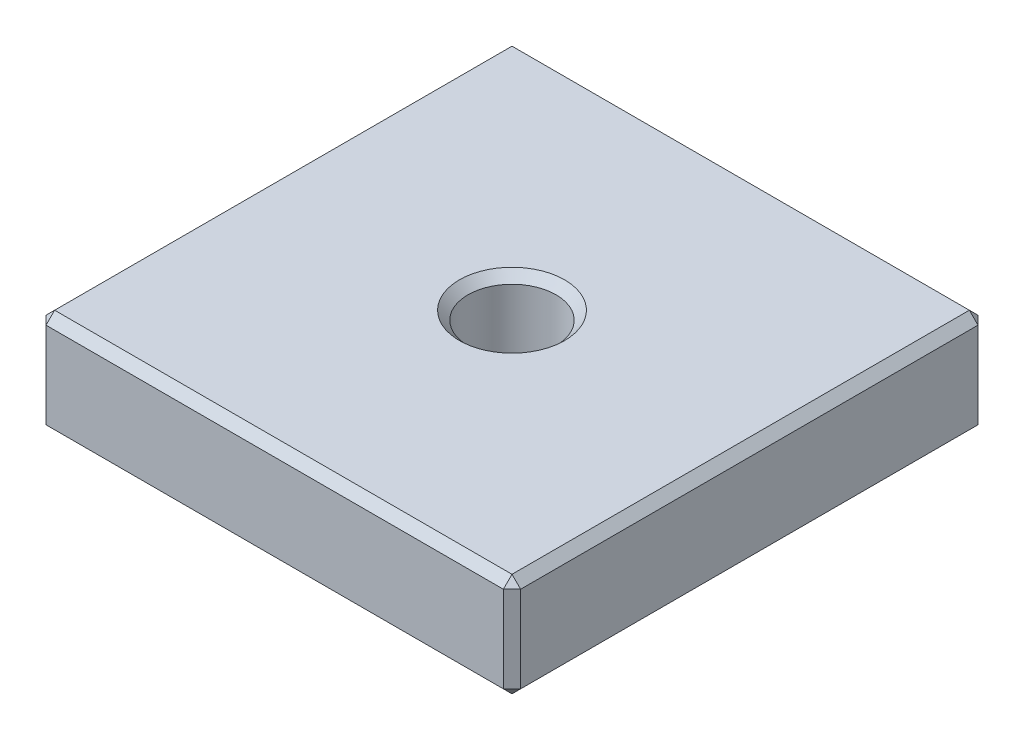
ISO-10303-21;
HEADER;
FILE_DESCRIPTION(('STEP AP214'),'2;1');
FILE_NAME('part.step','',(''),(''),'','','');
FILE_SCHEMA(('AUTOMOTIVE_DESIGN { 1 0 10303 214 1 1 1 1 }'));
ENDSEC;
DATA;
#1=APPLICATION_CONTEXT('core data for automotive mechanical design processes');
#2=APPLICATION_PROTOCOL_DEFINITION('international standard','automotive_design',2000,#1);
#3=PRODUCT_CONTEXT('',#1,'mechanical');
#4=PRODUCT('Part','Part','',(#3));
#5=PRODUCT_RELATED_PRODUCT_CATEGORY('part','',(#4));
#6=PRODUCT_DEFINITION_FORMATION('','',#4);
#7=PRODUCT_DEFINITION_CONTEXT('part definition',#1,'design');
#8=PRODUCT_DEFINITION('design','',#6,#7);
#9=PRODUCT_DEFINITION_SHAPE('','',#8);
#10=(LENGTH_UNIT() NAMED_UNIT(*) SI_UNIT(.MILLI.,.METRE.));
#11=(NAMED_UNIT(*) PLANE_ANGLE_UNIT() SI_UNIT($,.RADIAN.));
#12=(NAMED_UNIT(*) SI_UNIT($,.STERADIAN.) SOLID_ANGLE_UNIT());
#13=UNCERTAINTY_MEASURE_WITH_UNIT(LENGTH_MEASURE(1.E-05),#10,'distance_accuracy_value','');
#14=(GEOMETRIC_REPRESENTATION_CONTEXT(3) GLOBAL_UNCERTAINTY_ASSIGNED_CONTEXT((#13)) GLOBAL_UNIT_ASSIGNED_CONTEXT((#10,
#11,#12)) REPRESENTATION_CONTEXT('',''));
#15=CARTESIAN_POINT('',(0.,0.,0.));
#16=DIRECTION('',(0.,0.,1.));
#17=DIRECTION('',(1.,0.,0.));
#18=AXIS2_PLACEMENT_3D('',#15,#16,#17);
#19=CARTESIAN_POINT('',(0.,12.,0.));
#20=DIRECTION('',(1.,0.,0.));
#21=DIRECTION('',(0.,0.,-1.));
#22=AXIS2_PLACEMENT_3D('',#19,#20,#21);
#23=PLANE('',#22);
#24=DIRECTION('',(0.,1.,0.));
#25=VECTOR('',#24,1.);
#26=CARTESIAN_POINT('',(0.,12.,-1.));
#27=LINE('',#26,#25);
#28=CARTESIAN_POINT('',(0.,1.,-1.));
#29=VERTEX_POINT('',#28);
#30=CARTESIAN_POINT('',(0.,11.,-1.));
#31=VERTEX_POINT('',#30);
#32=EDGE_CURVE('E43',#29,#31,#27,.T.);
#33=ORIENTED_EDGE('',*,*,#32,.T.);
#34=DIRECTION('',(0.,0.,-1.));
#35=VECTOR('',#34,1.);
#36=CARTESIAN_POINT('',(0.,11.,0.));
#37=LINE('',#36,#35);
#38=CARTESIAN_POINT('',(0.,11.,-54.));
#39=VERTEX_POINT('',#38);
#40=EDGE_CURVE('E11',#31,#39,#37,.T.);
#41=ORIENTED_EDGE('',*,*,#40,.T.);
#42=DIRECTION('',(0.,-1.,0.));
#43=VECTOR('',#42,1.);
#44=CARTESIAN_POINT('',(0.,12.,-54.));
#45=LINE('',#44,#43);
#46=CARTESIAN_POINT('',(0.,1.,-54.));
#47=VERTEX_POINT('',#46);
#48=EDGE_CURVE('E208',#39,#47,#45,.T.);
#49=ORIENTED_EDGE('',*,*,#48,.T.);
#50=DIRECTION('',(0.,0.,1.));
#51=VECTOR('',#50,1.);
#52=CARTESIAN_POINT('',(0.,1.,0.));
#53=LINE('',#52,#51);
#54=EDGE_CURVE('E54',#47,#29,#53,.T.);
#55=ORIENTED_EDGE('',*,*,#54,.T.);
#56=EDGE_LOOP('',(#33,#41,#49,#55));
#57=FACE_BOUND('',#56,.T.);
#58=ADVANCED_FACE('F34',(#57),#23,.F.);
#59=CARTESIAN_POINT('',(0.,12.,0.));
#60=DIRECTION('',(0.,0.,-1.));
#61=DIRECTION('',(-1.,0.,0.));
#62=AXIS2_PLACEMENT_3D('',#59,#60,#61);
#63=PLANE('',#62);
#64=DIRECTION('',(1.,0.,0.));
#65=VECTOR('',#64,1.);
#66=CARTESIAN_POINT('',(55.,1.,0.));
#67=LINE('',#66,#65);
#68=CARTESIAN_POINT('',(1.00000000000001,1.,0.));
#69=VERTEX_POINT('',#68);
#70=CARTESIAN_POINT('',(54.,1.,0.));
#71=VERTEX_POINT('',#70);
#72=EDGE_CURVE('E201',#69,#71,#67,.T.);
#73=ORIENTED_EDGE('',*,*,#72,.T.);
#74=DIRECTION('',(0.,1.,0.));
#75=VECTOR('',#74,1.);
#76=CARTESIAN_POINT('',(54.,12.,0.));
#77=LINE('',#76,#75);
#78=CARTESIAN_POINT('',(54.,11.,0.));
#79=VERTEX_POINT('',#78);
#80=EDGE_CURVE('E206',#71,#79,#77,.T.);
#81=ORIENTED_EDGE('',*,*,#80,.T.);
#82=DIRECTION('',(-1.,0.,0.));
#83=VECTOR('',#82,1.);
#84=CARTESIAN_POINT('',(0.,11.,0.));
#85=LINE('',#84,#83);
#86=CARTESIAN_POINT('',(1.00000000000001,11.,0.));
#87=VERTEX_POINT('',#86);
#88=EDGE_CURVE('E203',#79,#87,#85,.T.);
#89=ORIENTED_EDGE('',*,*,#88,.T.);
#90=DIRECTION('',(0.,-1.,0.));
#91=VECTOR('',#90,1.);
#92=CARTESIAN_POINT('',(1.00000000000001,12.,0.));
#93=LINE('',#92,#91);
#94=EDGE_CURVE('E199',#87,#69,#93,.T.);
#95=ORIENTED_EDGE('',*,*,#94,.T.);
#96=EDGE_LOOP('',(#73,#81,#89,#95));
#97=FACE_BOUND('',#96,.T.);
#98=ADVANCED_FACE('F294',(#97),#63,.F.);
#99=CARTESIAN_POINT('',(55.,12.,0.));
#100=DIRECTION('',(-1.,0.,0.));
#101=DIRECTION('',(0.,0.,1.));
#102=AXIS2_PLACEMENT_3D('',#99,#100,#101);
#103=PLANE('',#102);
#104=DIRECTION('',(0.,1.,0.));
#105=VECTOR('',#104,1.);
#106=CARTESIAN_POINT('',(55.,12.,-54.));
#107=LINE('',#106,#105);
#108=CARTESIAN_POINT('',(55.,1.,-54.));
#109=VERTEX_POINT('',#108);
#110=CARTESIAN_POINT('',(55.,11.,-54.));
#111=VERTEX_POINT('',#110);
#112=EDGE_CURVE('E190',#109,#111,#107,.T.);
#113=ORIENTED_EDGE('',*,*,#112,.T.);
#114=DIRECTION('',(0.,0.,1.));
#115=VECTOR('',#114,1.);
#116=CARTESIAN_POINT('',(55.,11.,0.));
#117=LINE('',#116,#115);
#118=CARTESIAN_POINT('',(55.,11.,-1.));
#119=VERTEX_POINT('',#118);
#120=EDGE_CURVE('E196',#111,#119,#117,.T.);
#121=ORIENTED_EDGE('',*,*,#120,.T.);
#122=DIRECTION('',(0.,-1.,0.));
#123=VECTOR('',#122,1.);
#124=CARTESIAN_POINT('',(55.,12.,-1.));
#125=LINE('',#124,#123);
#126=CARTESIAN_POINT('',(55.,1.,-1.));
#127=VERTEX_POINT('',#126);
#128=EDGE_CURVE('E194',#119,#127,#125,.T.);
#129=ORIENTED_EDGE('',*,*,#128,.T.);
#130=DIRECTION('',(0.,0.,-1.));
#131=VECTOR('',#130,1.);
#132=CARTESIAN_POINT('',(55.,1.,-55.));
#133=LINE('',#132,#131);
#134=EDGE_CURVE('E192',#127,#109,#133,.T.);
#135=ORIENTED_EDGE('',*,*,#134,.T.);
#136=EDGE_LOOP('',(#113,#121,#129,#135));
#137=FACE_BOUND('',#136,.T.);
#138=ADVANCED_FACE('F285',(#137),#103,.F.);
#139=CARTESIAN_POINT('',(0.,12.,-55.));
#140=DIRECTION('',(0.,0.,1.));
#141=DIRECTION('',(1.,0.,0.));
#142=AXIS2_PLACEMENT_3D('',#139,#140,#141);
#143=PLANE('',#142);
#144=DIRECTION('',(0.,1.,0.));
#145=VECTOR('',#144,1.);
#146=CARTESIAN_POINT('',(1.00000000000001,12.,-55.));
#147=LINE('',#146,#145);
#148=CARTESIAN_POINT('',(1.00000000000001,1.00000000000001,-55.));
#149=VERTEX_POINT('',#148);
#150=CARTESIAN_POINT('',(1.00000000000001,11.,-55.));
#151=VERTEX_POINT('',#150);
#152=EDGE_CURVE('E183',#149,#151,#147,.T.);
#153=ORIENTED_EDGE('',*,*,#152,.T.);
#154=DIRECTION('',(1.,0.,0.));
#155=VECTOR('',#154,1.);
#156=CARTESIAN_POINT('',(0.,11.,-55.));
#157=LINE('',#156,#155);
#158=CARTESIAN_POINT('',(54.,11.,-55.));
#159=VERTEX_POINT('',#158);
#160=EDGE_CURVE('E130',#151,#159,#157,.T.);
#161=ORIENTED_EDGE('',*,*,#160,.T.);
#162=DIRECTION('',(0.,-1.,0.));
#163=VECTOR('',#162,1.);
#164=CARTESIAN_POINT('',(54.,12.,-55.));
#165=LINE('',#164,#163);
#166=CARTESIAN_POINT('',(54.,1.00000000000001,-55.));
#167=VERTEX_POINT('',#166);
#168=EDGE_CURVE('E187',#159,#167,#165,.T.);
#169=ORIENTED_EDGE('',*,*,#168,.T.);
#170=DIRECTION('',(-1.,0.,0.));
#171=VECTOR('',#170,1.);
#172=CARTESIAN_POINT('',(0.,1.00000000000001,-55.));
#173=LINE('',#172,#171);
#174=EDGE_CURVE('E185',#167,#149,#173,.T.);
#175=ORIENTED_EDGE('',*,*,#174,.T.);
#176=EDGE_LOOP('',(#153,#161,#169,#175));
#177=FACE_BOUND('',#176,.T.);
#178=ADVANCED_FACE('F321',(#177),#143,.F.);
#179=CARTESIAN_POINT('',(0.,12.,-55.));
#180=DIRECTION('',(0.,-1.,0.));
#181=DIRECTION('',(0.,0.,-1.));
#182=AXIS2_PLACEMENT_3D('',#179,#180,#181);
#183=PLANE('',#182);
#184=CARTESIAN_POINT('',(27.5,12.,-27.5));
#185=DIRECTION('',(0.,-1.,0.));
#186=DIRECTION('',(0.,0.,-1.));
#187=AXIS2_PLACEMENT_3D('',#184,#185,#186);
#188=CIRCLE('',#187,6.09999999999997);
#189=CARTESIAN_POINT('',(27.5,12.,-33.6));
#190=VERTEX_POINT('',#189);
#191=EDGE_CURVE('E158',#190,#190,#188,.T.);
#192=ORIENTED_EDGE('',*,*,#191,.T.);
#193=EDGE_LOOP('',(#192));
#194=FACE_BOUND('',#193,.T.);
#195=DIRECTION('',(0.,0.,-1.));
#196=VECTOR('',#195,1.);
#197=CARTESIAN_POINT('',(54.,12.,-55.));
#198=LINE('',#197,#196);
#199=CARTESIAN_POINT('',(54.,12.,-1.));
#200=VERTEX_POINT('',#199);
#201=CARTESIAN_POINT('',(54.,12.,-54.));
#202=VERTEX_POINT('',#201);
#203=EDGE_CURVE('E156',#200,#202,#198,.T.);
#204=ORIENTED_EDGE('',*,*,#203,.T.);
#205=DIRECTION('',(-1.,0.,0.));
#206=VECTOR('',#205,1.);
#207=CARTESIAN_POINT('',(0.,12.,-54.));
#208=LINE('',#207,#206);
#209=CARTESIAN_POINT('',(1.00000000000001,12.,-54.));
#210=VERTEX_POINT('',#209);
#211=EDGE_CURVE('E128',#202,#210,#208,.T.);
#212=ORIENTED_EDGE('',*,*,#211,.T.);
#213=DIRECTION('',(0.,0.,1.));
#214=VECTOR('',#213,1.);
#215=CARTESIAN_POINT('',(1.00000000000001,12.,-55.));
#216=LINE('',#215,#214);
#217=CARTESIAN_POINT('',(1.00000000000001,12.,-1.));
#218=VERTEX_POINT('',#217);
#219=EDGE_CURVE('E146',#210,#218,#216,.T.);
#220=ORIENTED_EDGE('',*,*,#219,.T.);
#221=DIRECTION('',(1.,0.,0.));
#222=VECTOR('',#221,1.);
#223=CARTESIAN_POINT('',(0.,12.,-1.));
#224=LINE('',#223,#222);
#225=EDGE_CURVE('E152',#218,#200,#224,.T.);
#226=ORIENTED_EDGE('',*,*,#225,.T.);
#227=EDGE_LOOP('',(#204,#212,#220,#226));
#228=FACE_BOUND('',#227,.T.);
#229=ADVANCED_FACE('F154',(#194,#228),#183,.F.);
#230=CARTESIAN_POINT('',(0.,0.,-55.));
#231=DIRECTION('',(0.,-1.,0.));
#232=DIRECTION('',(0.,0.,-1.));
#233=AXIS2_PLACEMENT_3D('',#230,#231,#232);
#234=PLANE('',#233);
#235=CARTESIAN_POINT('',(27.5,0.,-27.5));
#236=DIRECTION('',(0.,-1.,0.));
#237=DIRECTION('',(0.,0.,-1.));
#238=AXIS2_PLACEMENT_3D('',#235,#236,#237);
#239=CIRCLE('',#238,6.09999999999998);
#240=CARTESIAN_POINT('',(27.5,0.,-33.6));
#241=VERTEX_POINT('',#240);
#242=EDGE_CURVE('E180',#241,#241,#239,.F.);
#243=ORIENTED_EDGE('',*,*,#242,.T.);
#244=EDGE_LOOP('',(#243));
#245=FACE_BOUND('',#244,.T.);
#246=DIRECTION('',(0.,0.,1.));
#247=VECTOR('',#246,1.);
#248=CARTESIAN_POINT('',(54.,0.,0.));
#249=LINE('',#248,#247);
#250=CARTESIAN_POINT('',(54.,0.,-54.));
#251=VERTEX_POINT('',#250);
#252=CARTESIAN_POINT('',(54.,0.,-1.00000000000001));
#253=VERTEX_POINT('',#252);
#254=EDGE_CURVE('E175',#251,#253,#249,.T.);
#255=ORIENTED_EDGE('',*,*,#254,.T.);
#256=DIRECTION('',(-1.,0.,0.));
#257=VECTOR('',#256,1.);
#258=CARTESIAN_POINT('',(0.,0.,-1.00000000000001));
#259=LINE('',#258,#257);
#260=CARTESIAN_POINT('',(1.00000000000001,0.,-1.00000000000001));
#261=VERTEX_POINT('',#260);
#262=EDGE_CURVE('E177',#253,#261,#259,.T.);
#263=ORIENTED_EDGE('',*,*,#262,.T.);
#264=DIRECTION('',(0.,0.,-1.));
#265=VECTOR('',#264,1.);
#266=CARTESIAN_POINT('',(1.00000000000001,0.,-55.));
#267=LINE('',#266,#265);
#268=CARTESIAN_POINT('',(1.00000000000001,0.,-54.));
#269=VERTEX_POINT('',#268);
#270=EDGE_CURVE('E171',#261,#269,#267,.T.);
#271=ORIENTED_EDGE('',*,*,#270,.T.);
#272=DIRECTION('',(1.,0.,0.));
#273=VECTOR('',#272,1.);
#274=CARTESIAN_POINT('',(55.,0.,-54.));
#275=LINE('',#274,#273);
#276=EDGE_CURVE('E173',#269,#251,#275,.T.);
#277=ORIENTED_EDGE('',*,*,#276,.T.);
#278=EDGE_LOOP('',(#255,#263,#271,#277));
#279=FACE_BOUND('',#278,.T.);
#280=ADVANCED_FACE('F305',(#245,#279),#234,.T.);
#281=CARTESIAN_POINT('',(27.5,0.,-27.5));
#282=DIRECTION('',(0.,-1.,0.));
#283=DIRECTION('',(0.,0.,-1.));
#284=AXIS2_PLACEMENT_3D('',#281,#282,#283);
#285=CYLINDRICAL_SURFACE('',#284,5.09999999999999);
#286=CARTESIAN_POINT('',(27.5,11.,-27.5));
#287=DIRECTION('',(0.,-1.,0.));
#288=DIRECTION('',(0.,0.,-1.));
#289=AXIS2_PLACEMENT_3D('',#286,#287,#288);
#290=CIRCLE('',#289,5.09999999999999);
#291=CARTESIAN_POINT('',(27.5,11.,-32.6));
#292=VERTEX_POINT('',#291);
#293=EDGE_CURVE('E168',#292,#292,#290,.F.);
#294=ORIENTED_EDGE('',*,*,#293,.T.);
#295=EDGE_LOOP('',(#294));
#296=FACE_BOUND('',#295,.T.);
#297=CARTESIAN_POINT('',(27.5,0.999999999999984,-27.5));
#298=DIRECTION('',(0.,-1.,0.));
#299=DIRECTION('',(0.,0.,-1.));
#300=AXIS2_PLACEMENT_3D('',#297,#298,#299);
#301=CIRCLE('',#300,5.09999999999999);
#302=CARTESIAN_POINT('',(27.5,0.999999999999984,-32.6));
#303=VERTEX_POINT('',#302);
#304=EDGE_CURVE('E161',#303,#303,#301,.T.);
#305=ORIENTED_EDGE('',*,*,#304,.T.);
#306=EDGE_LOOP('',(#305));
#307=FACE_BOUND('',#306,.T.);
#308=ADVANCED_FACE('F356',(#296,#307),#285,.F.);
#309=CARTESIAN_POINT('',(27.5,12.,-27.5));
#310=DIRECTION('',(0.,1.,0.));
#311=DIRECTION('',(0.,0.,1.));
#312=AXIS2_PLACEMENT_3D('',#309,#310,#311);
#313=CONICAL_SURFACE('',#312,6.09999999999997,0.785398163397447);
#314=ORIENTED_EDGE('',*,*,#293,.F.);
#315=EDGE_LOOP('',(#314));
#316=FACE_BOUND('',#315,.T.);
#317=ORIENTED_EDGE('',*,*,#191,.F.);
#318=EDGE_LOOP('',(#317));
#319=FACE_BOUND('',#318,.T.);
#320=ADVANCED_FACE('F352',(#316,#319),#313,.F.);
#321=CARTESIAN_POINT('',(27.5,0.999999999999984,-27.5));
#322=DIRECTION('',(0.,-1.,0.));
#323=DIRECTION('',(0.,0.,-1.));
#324=AXIS2_PLACEMENT_3D('',#321,#322,#323);
#325=CONICAL_SURFACE('',#324,5.09999999999999,0.785398163397447);
#326=ORIENTED_EDGE('',*,*,#242,.F.);
#327=EDGE_LOOP('',(#326));
#328=FACE_BOUND('',#327,.T.);
#329=ORIENTED_EDGE('',*,*,#304,.F.);
#330=EDGE_LOOP('',(#329));
#331=FACE_BOUND('',#330,.T.);
#332=ADVANCED_FACE('F355',(#328,#331),#325,.F.);
#333=CARTESIAN_POINT('',(0.,1.,0.));
#334=DIRECTION('',(0.,-0.70710678118655,0.707106781186545));
#335=DIRECTION('',(0.,-0.707106781186545,-0.70710678118655));
#336=AXIS2_PLACEMENT_3D('',#333,#334,#335);
#337=PLANE('',#336);
#338=DIRECTION('',(0.,-0.707106781186545,-0.70710678118655));
#339=VECTOR('',#338,1.);
#340=CARTESIAN_POINT('',(54.,1.,0.));
#341=LINE('',#340,#339);
#342=EDGE_CURVE('E38',#71,#253,#341,.T.);
#343=ORIENTED_EDGE('',*,*,#342,.F.);
#344=ORIENTED_EDGE('',*,*,#72,.F.);
#345=DIRECTION('',(0.,0.707106781186545,0.70710678118655));
#346=VECTOR('',#345,1.);
#347=CARTESIAN_POINT('',(1.00000000000001,0.,-1.00000000000001));
#348=LINE('',#347,#346);
#349=EDGE_CURVE('E261',#261,#69,#348,.T.);
#350=ORIENTED_EDGE('',*,*,#349,.F.);
#351=ORIENTED_EDGE('',*,*,#262,.F.);
#352=EDGE_LOOP('',(#343,#344,#350,#351));
#353=FACE_BOUND('',#352,.T.);
#354=ADVANCED_FACE('F36',(#353),#337,.T.);
#355=CARTESIAN_POINT('',(54.,1.,0.));
#356=DIRECTION('',(0.577350269189622,-0.57735026918963,0.577350269189626));
#357=DIRECTION('',(0.,-0.707106781186545,-0.70710678118655));
#358=AXIS2_PLACEMENT_3D('',#355,#356,#357);
#359=PLANE('',#358);
#360=DIRECTION('',(0.70710678118655,0.,-0.707106781186545));
#361=VECTOR('',#360,1.);
#362=CARTESIAN_POINT('',(54.,1.,0.));
#363=LINE('',#362,#361);
#364=EDGE_CURVE('E256',#71,#127,#363,.T.);
#365=ORIENTED_EDGE('',*,*,#364,.F.);
#366=ORIENTED_EDGE('',*,*,#342,.T.);
#367=DIRECTION('',(0.70710678118655,0.707106781186545,0.));
#368=VECTOR('',#367,1.);
#369=CARTESIAN_POINT('',(54.5,0.5,-1.));
#370=LINE('',#369,#368);
#371=EDGE_CURVE('E259',#127,#253,#370,.F.);
#372=ORIENTED_EDGE('',*,*,#371,.F.);
#373=EDGE_LOOP('',(#365,#366,#372));
#374=FACE_BOUND('',#373,.T.);
#375=ADVANCED_FACE('F272',(#374),#359,.T.);
#376=CARTESIAN_POINT('',(1.00000000000001,0.,-1.00000000000001));
#377=DIRECTION('',(-0.577350269189622,-0.57735026918963,0.577350269189626));
#378=DIRECTION('',(0.,-0.707106781186545,-0.70710678118655));
#379=AXIS2_PLACEMENT_3D('',#376,#377,#378);
#380=PLANE('',#379);
#381=DIRECTION('',(0.70710678118655,-0.707106781186545,0.));
#382=VECTOR('',#381,1.);
#383=CARTESIAN_POINT('',(1.00000000000001,0.,-1.00000000000001));
#384=LINE('',#383,#382);
#385=EDGE_CURVE('E251',#261,#29,#384,.F.);
#386=ORIENTED_EDGE('',*,*,#385,.F.);
#387=ORIENTED_EDGE('',*,*,#349,.T.);
#388=DIRECTION('',(0.70710678118655,0.,0.707106781186545));
#389=VECTOR('',#388,1.);
#390=CARTESIAN_POINT('',(0.500000000000004,1.,-0.5));
#391=LINE('',#390,#389);
#392=EDGE_CURVE('E253',#29,#69,#391,.T.);
#393=ORIENTED_EDGE('',*,*,#392,.F.);
#394=EDGE_LOOP('',(#386,#387,#393));
#395=FACE_BOUND('',#394,.T.);
#396=ADVANCED_FACE('F480',(#395),#380,.T.);
#397=CARTESIAN_POINT('',(55.,1.,0.));
#398=DIRECTION('',(0.707106781186545,-0.70710678118655,0.));
#399=DIRECTION('',(0.70710678118655,0.707106781186545,0.));
#400=AXIS2_PLACEMENT_3D('',#397,#398,#399);
#401=PLANE('',#400);
#402=ORIENTED_EDGE('',*,*,#371,.T.);
#403=ORIENTED_EDGE('',*,*,#254,.F.);
#404=DIRECTION('',(-0.70710678118655,-0.707106781186545,0.));
#405=VECTOR('',#404,1.);
#406=CARTESIAN_POINT('',(55.,1.,-54.));
#407=LINE('',#406,#405);
#408=EDGE_CURVE('E245',#109,#251,#407,.T.);
#409=ORIENTED_EDGE('',*,*,#408,.F.);
#410=ORIENTED_EDGE('',*,*,#134,.F.);
#411=EDGE_LOOP('',(#402,#403,#409,#410));
#412=FACE_BOUND('',#411,.T.);
#413=ADVANCED_FACE('F280',(#412),#401,.T.);
#414=CARTESIAN_POINT('',(55.,12.,-1.));
#415=DIRECTION('',(-0.707106781186545,0.,-0.70710678118655));
#416=DIRECTION('',(-0.70710678118655,0.,0.707106781186545));
#417=AXIS2_PLACEMENT_3D('',#414,#415,#416);
#418=PLANE('',#417);
#419=ORIENTED_EDGE('',*,*,#364,.T.);
#420=ORIENTED_EDGE('',*,*,#128,.F.);
#421=DIRECTION('',(-0.70710678118655,0.,0.707106781186545));
#422=VECTOR('',#421,1.);
#423=CARTESIAN_POINT('',(55.,11.,-1.));
#424=LINE('',#423,#422);
#425=EDGE_CURVE('E242',#79,#119,#424,.F.);
#426=ORIENTED_EDGE('',*,*,#425,.F.);
#427=ORIENTED_EDGE('',*,*,#80,.F.);
#428=EDGE_LOOP('',(#419,#420,#426,#427));
#429=FACE_BOUND('',#428,.T.);
#430=ADVANCED_FACE('F291',(#429),#418,.F.);
#431=CARTESIAN_POINT('',(0.,12.,-1.));
#432=DIRECTION('',(0.,-0.707106781186545,-0.70710678118655));
#433=DIRECTION('',(0.,0.70710678118655,-0.707106781186545));
#434=AXIS2_PLACEMENT_3D('',#431,#432,#433);
#435=PLANE('',#434);
#436=DIRECTION('',(0.,-0.70710678118655,0.707106781186545));
#437=VECTOR('',#436,1.);
#438=CARTESIAN_POINT('',(1.00000000000001,11.,0.));
#439=LINE('',#438,#437);
#440=EDGE_CURVE('E236',#87,#218,#439,.F.);
#441=ORIENTED_EDGE('',*,*,#440,.F.);
#442=ORIENTED_EDGE('',*,*,#88,.F.);
#443=DIRECTION('',(0.,0.70710678118655,-0.707106781186545));
#444=VECTOR('',#443,1.);
#445=CARTESIAN_POINT('',(54.,11.5,-0.5));
#446=LINE('',#445,#444);
#447=EDGE_CURVE('E239',#200,#79,#446,.F.);
#448=ORIENTED_EDGE('',*,*,#447,.F.);
#449=ORIENTED_EDGE('',*,*,#225,.F.);
#450=EDGE_LOOP('',(#441,#442,#448,#449));
#451=FACE_BOUND('',#450,.T.);
#452=ADVANCED_FACE('F298',(#451),#435,.F.);
#453=CARTESIAN_POINT('',(1.00000000000001,12.,0.));
#454=DIRECTION('',(0.707106781186545,0.,-0.70710678118655));
#455=DIRECTION('',(-0.70710678118655,0.,-0.707106781186545));
#456=AXIS2_PLACEMENT_3D('',#453,#454,#455);
#457=PLANE('',#456);
#458=ORIENTED_EDGE('',*,*,#392,.T.);
#459=ORIENTED_EDGE('',*,*,#94,.F.);
#460=DIRECTION('',(-0.70710678118655,0.,-0.707106781186545));
#461=VECTOR('',#460,1.);
#462=CARTESIAN_POINT('',(1.00000000000001,11.,0.));
#463=LINE('',#462,#461);
#464=EDGE_CURVE('E234',#31,#87,#463,.F.);
#465=ORIENTED_EDGE('',*,*,#464,.F.);
#466=ORIENTED_EDGE('',*,*,#32,.F.);
#467=EDGE_LOOP('',(#458,#459,#465,#466));
#468=FACE_BOUND('',#467,.T.);
#469=ADVANCED_FACE('F303',(#468),#457,.F.);
#470=CARTESIAN_POINT('',(0.,1.,0.));
#471=DIRECTION('',(-0.707106781186545,-0.70710678118655,0.));
#472=DIRECTION('',(0.70710678118655,-0.707106781186545,0.));
#473=AXIS2_PLACEMENT_3D('',#470,#471,#472);
#474=PLANE('',#473);
#475=ORIENTED_EDGE('',*,*,#385,.T.);
#476=ORIENTED_EDGE('',*,*,#54,.F.);
#477=DIRECTION('',(-0.70710678118655,0.707106781186545,0.));
#478=VECTOR('',#477,1.);
#479=CARTESIAN_POINT('',(0.500000000000004,0.5,-54.));
#480=LINE('',#479,#478);
#481=EDGE_CURVE('E231',#269,#47,#480,.T.);
#482=ORIENTED_EDGE('',*,*,#481,.F.);
#483=ORIENTED_EDGE('',*,*,#270,.F.);
#484=EDGE_LOOP('',(#475,#476,#482,#483));
#485=FACE_BOUND('',#484,.T.);
#486=ADVANCED_FACE('F314',(#485),#474,.T.);
#487=CARTESIAN_POINT('',(0.,1.00000000000001,-55.));
#488=DIRECTION('',(0.,-0.707106781186545,-0.70710678118655));
#489=DIRECTION('',(0.,0.70710678118655,-0.707106781186545));
#490=AXIS2_PLACEMENT_3D('',#487,#488,#489);
#491=PLANE('',#490);
#492=DIRECTION('',(0.,0.70710678118655,-0.707106781186545));
#493=VECTOR('',#492,1.);
#494=CARTESIAN_POINT('',(54.,0.500000000000004,-54.5));
#495=LINE('',#494,#493);
#496=EDGE_CURVE('E248',#251,#167,#495,.T.);
#497=ORIENTED_EDGE('',*,*,#496,.F.);
#498=ORIENTED_EDGE('',*,*,#276,.F.);
#499=DIRECTION('',(0.,-0.70710678118655,0.707106781186545));
#500=VECTOR('',#499,1.);
#501=CARTESIAN_POINT('',(1.00000000000001,1.00000000000001,-55.));
#502=LINE('',#501,#500);
#503=EDGE_CURVE('E228',#149,#269,#502,.T.);
#504=ORIENTED_EDGE('',*,*,#503,.F.);
#505=ORIENTED_EDGE('',*,*,#174,.F.);
#506=EDGE_LOOP('',(#497,#498,#504,#505));
#507=FACE_BOUND('',#506,.T.);
#508=ADVANCED_FACE('F310',(#507),#491,.T.);
#509=CARTESIAN_POINT('',(55.,1.,-54.));
#510=DIRECTION('',(0.577350269189622,-0.577350269189626,-0.57735026918963));
#511=DIRECTION('',(0.,0.70710678118655,-0.707106781186545));
#512=AXIS2_PLACEMENT_3D('',#509,#510,#511);
#513=PLANE('',#512);
#514=ORIENTED_EDGE('',*,*,#408,.T.);
#515=ORIENTED_EDGE('',*,*,#496,.T.);
#516=DIRECTION('',(-0.70710678118655,0.,-0.707106781186545));
#517=VECTOR('',#516,1.);
#518=CARTESIAN_POINT('',(55.,1.,-54.));
#519=LINE('',#518,#517);
#520=EDGE_CURVE('E225',#109,#167,#519,.T.);
#521=ORIENTED_EDGE('',*,*,#520,.F.);
#522=EDGE_LOOP('',(#514,#515,#521));
#523=FACE_BOUND('',#522,.T.);
#524=ADVANCED_FACE('F324',(#523),#513,.T.);
#525=CARTESIAN_POINT('',(55.,11.,-1.));
#526=DIRECTION('',(0.577350269189626,0.577350269189622,0.57735026918963));
#527=DIRECTION('',(0.70710678118655,0.,-0.707106781186545));
#528=AXIS2_PLACEMENT_3D('',#525,#526,#527);
#529=PLANE('',#528);
#530=ORIENTED_EDGE('',*,*,#447,.T.);
#531=ORIENTED_EDGE('',*,*,#425,.T.);
#532=DIRECTION('',(0.707106781186545,-0.70710678118655,0.));
#533=VECTOR('',#532,1.);
#534=CARTESIAN_POINT('',(55.,11.,-1.));
#535=LINE('',#534,#533);
#536=EDGE_CURVE('E223',#200,#119,#535,.T.);
#537=ORIENTED_EDGE('',*,*,#536,.F.);
#538=EDGE_LOOP('',(#530,#531,#537));
#539=FACE_BOUND('',#538,.T.);
#540=ADVANCED_FACE('F334',(#539),#529,.T.);
#541=CARTESIAN_POINT('',(1.00000000000001,11.,0.));
#542=DIRECTION('',(-0.577350269189622,0.577350269189626,0.57735026918963));
#543=DIRECTION('',(0.,-0.70710678118655,0.707106781186545));
#544=AXIS2_PLACEMENT_3D('',#541,#542,#543);
#545=PLANE('',#544);
#546=ORIENTED_EDGE('',*,*,#464,.T.);
#547=ORIENTED_EDGE('',*,*,#440,.T.);
#548=DIRECTION('',(0.70710678118655,0.707106781186545,0.));
#549=VECTOR('',#548,1.);
#550=CARTESIAN_POINT('',(0.500000000000004,11.5,-1.));
#551=LINE('',#550,#549);
#552=EDGE_CURVE('E149',#31,#218,#551,.T.);
#553=ORIENTED_EDGE('',*,*,#552,.F.);
#554=EDGE_LOOP('',(#546,#547,#553));
#555=FACE_BOUND('',#554,.T.);
#556=ADVANCED_FACE('F336',(#555),#545,.T.);
#557=CARTESIAN_POINT('',(1.00000000000001,1.00000000000001,-55.));
#558=DIRECTION('',(-0.577350269189622,-0.577350269189626,-0.57735026918963));
#559=DIRECTION('',(0.,0.70710678118655,-0.707106781186545));
#560=AXIS2_PLACEMENT_3D('',#557,#558,#559);
#561=PLANE('',#560);
#562=ORIENTED_EDGE('',*,*,#503,.T.);
#563=ORIENTED_EDGE('',*,*,#481,.T.);
#564=DIRECTION('',(-0.70710678118655,0.,0.707106781186545));
#565=VECTOR('',#564,1.);
#566=CARTESIAN_POINT('',(1.00000000000001,1.00000000000001,-55.));
#567=LINE('',#566,#565);
#568=EDGE_CURVE('E219',#149,#47,#567,.T.);
#569=ORIENTED_EDGE('',*,*,#568,.F.);
#570=EDGE_LOOP('',(#562,#563,#569));
#571=FACE_BOUND('',#570,.T.);
#572=ADVANCED_FACE('F316',(#571),#561,.T.);
#573=CARTESIAN_POINT('',(54.,12.,-55.));
#574=DIRECTION('',(-0.707106781186545,0.,0.70710678118655));
#575=DIRECTION('',(0.70710678118655,0.,0.707106781186545));
#576=AXIS2_PLACEMENT_3D('',#573,#574,#575);
#577=PLANE('',#576);
#578=ORIENTED_EDGE('',*,*,#520,.T.);
#579=ORIENTED_EDGE('',*,*,#168,.F.);
#580=DIRECTION('',(0.70710678118655,0.,0.707106781186545));
#581=VECTOR('',#580,1.);
#582=CARTESIAN_POINT('',(54.,11.,-55.));
#583=LINE('',#582,#581);
#584=EDGE_CURVE('E216',#111,#159,#583,.F.);
#585=ORIENTED_EDGE('',*,*,#584,.F.);
#586=ORIENTED_EDGE('',*,*,#112,.F.);
#587=EDGE_LOOP('',(#578,#579,#585,#586));
#588=FACE_BOUND('',#587,.T.);
#589=ADVANCED_FACE('F326',(#588),#577,.F.);
#590=CARTESIAN_POINT('',(54.,12.,-55.));
#591=DIRECTION('',(-0.70710678118655,-0.707106781186545,0.));
#592=DIRECTION('',(0.707106781186545,-0.70710678118655,0.));
#593=AXIS2_PLACEMENT_3D('',#590,#591,#592);
#594=PLANE('',#593);
#595=ORIENTED_EDGE('',*,*,#536,.T.);
#596=ORIENTED_EDGE('',*,*,#120,.F.);
#597=DIRECTION('',(-0.707106781186545,0.70710678118655,0.));
#598=VECTOR('',#597,1.);
#599=CARTESIAN_POINT('',(54.5,11.5,-54.));
#600=LINE('',#599,#598);
#601=EDGE_CURVE('E143',#202,#111,#600,.F.);
#602=ORIENTED_EDGE('',*,*,#601,.F.);
#603=ORIENTED_EDGE('',*,*,#203,.F.);
#604=EDGE_LOOP('',(#595,#596,#602,#603));
#605=FACE_BOUND('',#604,.T.);
#606=ADVANCED_FACE('F332',(#605),#594,.F.);
#607=CARTESIAN_POINT('',(1.00000000000001,12.,-55.));
#608=DIRECTION('',(0.707106781186545,-0.70710678118655,0.));
#609=DIRECTION('',(0.70710678118655,0.707106781186545,0.));
#610=AXIS2_PLACEMENT_3D('',#607,#608,#609);
#611=PLANE('',#610);
#612=ORIENTED_EDGE('',*,*,#552,.T.);
#613=ORIENTED_EDGE('',*,*,#219,.F.);
#614=DIRECTION('',(-0.70710678118655,-0.707106781186545,0.));
#615=VECTOR('',#614,1.);
#616=CARTESIAN_POINT('',(1.00000000000001,12.,-54.));
#617=LINE('',#616,#615);
#618=EDGE_CURVE('E135',#39,#210,#617,.F.);
#619=ORIENTED_EDGE('',*,*,#618,.F.);
#620=ORIENTED_EDGE('',*,*,#40,.F.);
#621=EDGE_LOOP('',(#612,#613,#619,#620));
#622=FACE_BOUND('',#621,.T.);
#623=ADVANCED_FACE('F147',(#622),#611,.F.);
#624=CARTESIAN_POINT('',(0.,12.,-54.));
#625=DIRECTION('',(0.707106781186545,0.,0.70710678118655));
#626=DIRECTION('',(0.70710678118655,0.,-0.707106781186545));
#627=AXIS2_PLACEMENT_3D('',#624,#625,#626);
#628=PLANE('',#627);
#629=ORIENTED_EDGE('',*,*,#568,.T.);
#630=ORIENTED_EDGE('',*,*,#48,.F.);
#631=DIRECTION('',(0.70710678118655,0.,-0.707106781186545));
#632=VECTOR('',#631,1.);
#633=CARTESIAN_POINT('',(0.500000000000004,11.,-54.5));
#634=LINE('',#633,#632);
#635=EDGE_CURVE('E139',#151,#39,#634,.F.);
#636=ORIENTED_EDGE('',*,*,#635,.F.);
#637=ORIENTED_EDGE('',*,*,#152,.F.);
#638=EDGE_LOOP('',(#629,#630,#636,#637));
#639=FACE_BOUND('',#638,.T.);
#640=ADVANCED_FACE('F319',(#639),#628,.F.);
#641=CARTESIAN_POINT('',(54.,11.,-55.));
#642=DIRECTION('',(0.577350269189626,0.577350269189622,-0.57735026918963));
#643=DIRECTION('',(-0.70710678118655,0.,-0.707106781186545));
#644=AXIS2_PLACEMENT_3D('',#641,#642,#643);
#645=PLANE('',#644);
#646=ORIENTED_EDGE('',*,*,#601,.T.);
#647=ORIENTED_EDGE('',*,*,#584,.T.);
#648=DIRECTION('',(0.,-0.70710678118655,-0.707106781186545));
#649=VECTOR('',#648,1.);
#650=CARTESIAN_POINT('',(54.,11.,-55.));
#651=LINE('',#650,#649);
#652=EDGE_CURVE('E132',#202,#159,#651,.T.);
#653=ORIENTED_EDGE('',*,*,#652,.F.);
#654=EDGE_LOOP('',(#646,#647,#653));
#655=FACE_BOUND('',#654,.T.);
#656=ADVANCED_FACE('F330',(#655),#645,.T.);
#657=CARTESIAN_POINT('',(1.00000000000001,12.,-54.));
#658=DIRECTION('',(-0.577350269189622,0.577350269189626,-0.57735026918963));
#659=DIRECTION('',(0.,0.70710678118655,0.707106781186545));
#660=AXIS2_PLACEMENT_3D('',#657,#658,#659);
#661=PLANE('',#660);
#662=ORIENTED_EDGE('',*,*,#635,.T.);
#663=ORIENTED_EDGE('',*,*,#618,.T.);
#664=DIRECTION('',(0.,0.70710678118655,0.707106781186545));
#665=VECTOR('',#664,1.);
#666=CARTESIAN_POINT('',(1.00000000000001,12.,-54.));
#667=LINE('',#666,#665);
#668=EDGE_CURVE('E124',#151,#210,#667,.T.);
#669=ORIENTED_EDGE('',*,*,#668,.F.);
#670=EDGE_LOOP('',(#662,#663,#669));
#671=FACE_BOUND('',#670,.T.);
#672=ADVANCED_FACE('F137',(#671),#661,.T.);
#673=CARTESIAN_POINT('',(0.,12.,-54.));
#674=DIRECTION('',(0.,-0.707106781186545,0.70710678118655));
#675=DIRECTION('',(0.,-0.70710678118655,-0.707106781186545));
#676=AXIS2_PLACEMENT_3D('',#673,#674,#675);
#677=PLANE('',#676);
#678=ORIENTED_EDGE('',*,*,#652,.T.);
#679=ORIENTED_EDGE('',*,*,#160,.F.);
#680=ORIENTED_EDGE('',*,*,#668,.T.);
#681=ORIENTED_EDGE('',*,*,#211,.F.);
#682=EDGE_LOOP('',(#678,#679,#680,#681));
#683=FACE_BOUND('',#682,.T.);
#684=ADVANCED_FACE('F126',(#683),#677,.F.);
#685=CLOSED_SHELL('',(#58,#98,#138,#178,#229,#280,#308,#320,#332,#354,#375,#396,#413,#430,#452,
#469,#486,#508,#524,#540,#556,#572,#589,#606,#623,#640,#656,#672,#684));
#686=MANIFOLD_SOLID_BREP('B2',#685);
#687=ADVANCED_BREP_SHAPE_REPRESENTATION('',(#18,#686),#14);
#688=SHAPE_DEFINITION_REPRESENTATION(#9,#687);
ENDSEC;
END-ISO-10303-21;
